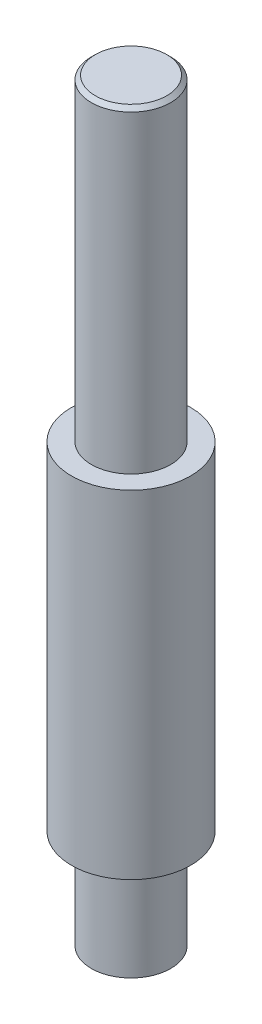
ISO-10303-21;
HEADER;
FILE_DESCRIPTION(('STEP AP214'),'2;1');
FILE_NAME('part.step','',(''),(''),'','','');
FILE_SCHEMA(('AUTOMOTIVE_DESIGN { 1 0 10303 214 1 1 1 1 }'));
ENDSEC;
DATA;
#1=APPLICATION_CONTEXT('core data for automotive mechanical design processes');
#2=APPLICATION_PROTOCOL_DEFINITION('international standard','automotive_design',2000,#1);
#3=PRODUCT_CONTEXT('',#1,'mechanical');
#4=PRODUCT('Part','Part','',(#3));
#5=PRODUCT_RELATED_PRODUCT_CATEGORY('part','',(#4));
#6=PRODUCT_DEFINITION_FORMATION('','',#4);
#7=PRODUCT_DEFINITION_CONTEXT('part definition',#1,'design');
#8=PRODUCT_DEFINITION('design','',#6,#7);
#9=PRODUCT_DEFINITION_SHAPE('','',#8);
#10=(LENGTH_UNIT() NAMED_UNIT(*) SI_UNIT(.MILLI.,.METRE.));
#11=(NAMED_UNIT(*) PLANE_ANGLE_UNIT() SI_UNIT($,.RADIAN.));
#12=(NAMED_UNIT(*) SI_UNIT($,.STERADIAN.) SOLID_ANGLE_UNIT());
#13=UNCERTAINTY_MEASURE_WITH_UNIT(LENGTH_MEASURE(1.E-05),#10,'distance_accuracy_value','');
#14=(GEOMETRIC_REPRESENTATION_CONTEXT(3) GLOBAL_UNCERTAINTY_ASSIGNED_CONTEXT((#13)) GLOBAL_UNIT_ASSIGNED_CONTEXT((#10,
#11,#12)) REPRESENTATION_CONTEXT('',''));
#15=CARTESIAN_POINT('',(0.,0.,0.));
#16=DIRECTION('',(0.,0.,1.));
#17=DIRECTION('',(1.,0.,0.));
#18=AXIS2_PLACEMENT_3D('',#15,#16,#17);
#19=CARTESIAN_POINT('',(0.,95.,0.));
#20=DIRECTION('',(0.,-1.,0.));
#21=DIRECTION('',(0.,0.,-1.));
#22=AXIS2_PLACEMENT_3D('',#19,#20,#21);
#23=CYLINDRICAL_SURFACE('',#22,10.);
#24=CARTESIAN_POINT('',(0.,94.,0.));
#25=DIRECTION('',(0.,1.,0.));
#26=DIRECTION('',(0.,0.,1.));
#27=AXIS2_PLACEMENT_3D('',#24,#25,#26);
#28=CIRCLE('',#27,10.);
#29=CARTESIAN_POINT('',(0.,94.,10.));
#30=VERTEX_POINT('',#29);
#31=EDGE_CURVE('E10',#30,#30,#28,.F.);
#32=ORIENTED_EDGE('',*,*,#31,.T.);
#33=EDGE_LOOP('',(#32));
#34=FACE_BOUND('',#33,.T.);
#35=CARTESIAN_POINT('',(0.,15.,0.));
#36=DIRECTION('',(0.,-1.,0.));
#37=DIRECTION('',(0.,0.,-1.));
#38=AXIS2_PLACEMENT_3D('',#35,#36,#37);
#39=CIRCLE('',#38,10.);
#40=CARTESIAN_POINT('',(0.,15.,-10.));
#41=VERTEX_POINT('',#40);
#42=EDGE_CURVE('E50',#41,#41,#39,.T.);
#43=ORIENTED_EDGE('',*,*,#42,.F.);
#44=EDGE_LOOP('',(#43));
#45=FACE_BOUND('',#44,.T.);
#46=ADVANCED_FACE('F38',(#34,#45),#23,.T.);
#47=CARTESIAN_POINT('',(0.,95.,0.));
#48=DIRECTION('',(0.,1.,0.));
#49=DIRECTION('',(0.,0.,1.));
#50=AXIS2_PLACEMENT_3D('',#47,#48,#49);
#51=PLANE('',#50);
#52=CARTESIAN_POINT('',(0.,95.,0.));
#53=DIRECTION('',(0.,1.,0.));
#54=DIRECTION('',(0.,0.,1.));
#55=AXIS2_PLACEMENT_3D('',#52,#53,#54);
#56=CIRCLE('',#55,9.00000000000001);
#57=CARTESIAN_POINT('',(0.,95.,9.00000000000001));
#58=VERTEX_POINT('',#57);
#59=EDGE_CURVE('E46',#58,#58,#56,.T.);
#60=ORIENTED_EDGE('',*,*,#59,.T.);
#61=EDGE_LOOP('',(#60));
#62=FACE_BOUND('',#61,.T.);
#63=ADVANCED_FACE('F84',(#62),#51,.T.);
#64=CARTESIAN_POINT('',(0.,15.,0.));
#65=DIRECTION('',(0.,-1.,0.));
#66=DIRECTION('',(0.,0.,-1.));
#67=AXIS2_PLACEMENT_3D('',#64,#65,#66);
#68=CYLINDRICAL_SURFACE('',#67,14.99);
#69=CARTESIAN_POINT('',(0.,15.,0.));
#70=DIRECTION('',(0.,-1.,0.));
#71=DIRECTION('',(0.,0.,-1.));
#72=AXIS2_PLACEMENT_3D('',#69,#70,#71);
#73=CIRCLE('',#72,14.99);
#74=CARTESIAN_POINT('',(0.,15.,-14.99));
#75=VERTEX_POINT('',#74);
#76=EDGE_CURVE('E60',#75,#75,#73,.T.);
#77=ORIENTED_EDGE('',*,*,#76,.T.);
#78=EDGE_LOOP('',(#77));
#79=FACE_BOUND('',#78,.T.);
#80=CARTESIAN_POINT('',(0.,-70.,0.));
#81=DIRECTION('',(0.,-1.,0.));
#82=DIRECTION('',(0.,0.,-1.));
#83=AXIS2_PLACEMENT_3D('',#80,#81,#82);
#84=CIRCLE('',#83,14.99);
#85=CARTESIAN_POINT('',(0.,-70.,-14.99));
#86=VERTEX_POINT('',#85);
#87=EDGE_CURVE('E63',#86,#86,#84,.T.);
#88=ORIENTED_EDGE('',*,*,#87,.F.);
#89=EDGE_LOOP('',(#88));
#90=FACE_BOUND('',#89,.T.);
#91=ADVANCED_FACE('F69',(#79,#90),#68,.T.);
#92=CARTESIAN_POINT('',(0.,15.,0.));
#93=DIRECTION('',(0.,-1.,0.));
#94=DIRECTION('',(0.,0.,-1.));
#95=AXIS2_PLACEMENT_3D('',#92,#93,#94);
#96=PLANE('',#95);
#97=ORIENTED_EDGE('',*,*,#42,.T.);
#98=EDGE_LOOP('',(#97));
#99=FACE_BOUND('',#98,.T.);
#100=ORIENTED_EDGE('',*,*,#76,.F.);
#101=EDGE_LOOP('',(#100));
#102=FACE_BOUND('',#101,.T.);
#103=ADVANCED_FACE('F72',(#99,#102),#96,.F.);
#104=CARTESIAN_POINT('',(0.,-70.,0.));
#105=DIRECTION('',(0.,-1.,0.));
#106=DIRECTION('',(0.,0.,-1.));
#107=AXIS2_PLACEMENT_3D('',#104,#105,#106);
#108=PLANE('',#107);
#109=CARTESIAN_POINT('',(0.,-70.,0.));
#110=DIRECTION('',(0.,-1.,0.));
#111=DIRECTION('',(0.,0.,-1.));
#112=AXIS2_PLACEMENT_3D('',#109,#110,#111);
#113=CIRCLE('',#112,10.);
#114=CARTESIAN_POINT('',(0.,-70.,-10.));
#115=VERTEX_POINT('',#114);
#116=EDGE_CURVE('E57',#115,#115,#113,.T.);
#117=ORIENTED_EDGE('',*,*,#116,.F.);
#118=EDGE_LOOP('',(#117));
#119=FACE_BOUND('',#118,.T.);
#120=ORIENTED_EDGE('',*,*,#87,.T.);
#121=EDGE_LOOP('',(#120));
#122=FACE_BOUND('',#121,.T.);
#123=ADVANCED_FACE('F74',(#119,#122),#108,.T.);
#124=CARTESIAN_POINT('',(0.,-95.,0.));
#125=DIRECTION('',(0.,1.,0.));
#126=DIRECTION('',(0.,0.,1.));
#127=AXIS2_PLACEMENT_3D('',#124,#125,#126);
#128=PLANE('',#127);
#129=CARTESIAN_POINT('',(0.,-95.,0.));
#130=DIRECTION('',(0.,1.,0.));
#131=DIRECTION('',(0.,0.,1.));
#132=AXIS2_PLACEMENT_3D('',#129,#130,#131);
#133=CIRCLE('',#132,10.);
#134=CARTESIAN_POINT('',(0.,-95.,10.));
#135=VERTEX_POINT('',#134);
#136=EDGE_CURVE('E54',#135,#135,#133,.T.);
#137=ORIENTED_EDGE('',*,*,#136,.F.);
#138=EDGE_LOOP('',(#137));
#139=FACE_BOUND('',#138,.T.);
#140=ADVANCED_FACE('F81',(#139),#128,.F.);
#141=ORIENTED_EDGE('',*,*,#116,.T.);
#142=EDGE_LOOP('',(#141));
#143=FACE_BOUND('',#142,.T.);
#144=ORIENTED_EDGE('',*,*,#136,.T.);
#145=EDGE_LOOP('',(#144));
#146=FACE_BOUND('',#145,.T.);
#147=ADVANCED_FACE('F87',(#143,#146),#23,.T.);
#148=CARTESIAN_POINT('',(0.,95.,0.));
#149=DIRECTION('',(0.,-1.,0.));
#150=DIRECTION('',(0.,0.,-1.));
#151=AXIS2_PLACEMENT_3D('',#148,#149,#150);
#152=CONICAL_SURFACE('',#151,9.00000000000001,0.785398163397444);
#153=ORIENTED_EDGE('',*,*,#31,.F.);
#154=EDGE_LOOP('',(#153));
#155=FACE_BOUND('',#154,.T.);
#156=ORIENTED_EDGE('',*,*,#59,.F.);
#157=EDGE_LOOP('',(#156));
#158=FACE_BOUND('',#157,.T.);
#159=ADVANCED_FACE('F41',(#155,#158),#152,.T.);
#160=CLOSED_SHELL('',(#46,#63,#91,#103,#123,#140,#147,#159));
#161=MANIFOLD_SOLID_BREP('B2',#160);
#162=ADVANCED_BREP_SHAPE_REPRESENTATION('',(#18,#161),#14);
#163=SHAPE_DEFINITION_REPRESENTATION(#9,#162);
ENDSEC;
END-ISO-10303-21;
